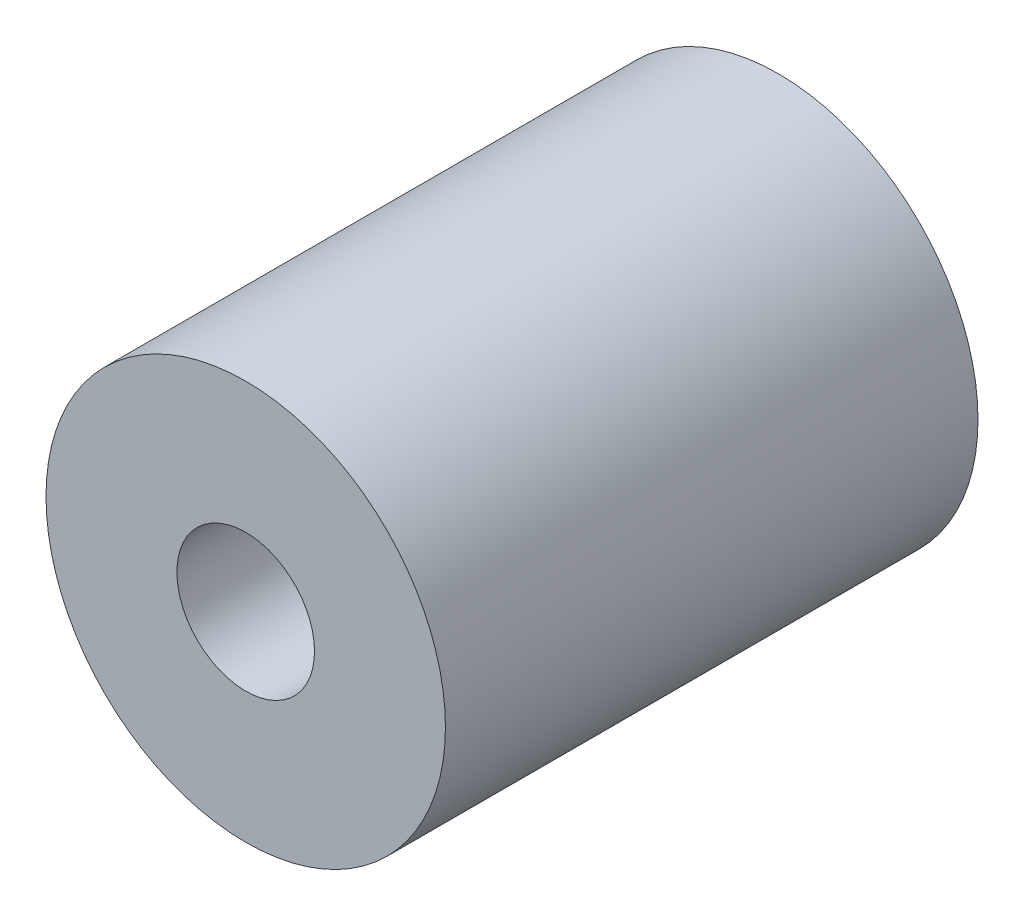
ISO-10303-21;
HEADER;
FILE_DESCRIPTION(('STEP AP214'),'2;1');
FILE_NAME('part.step','',(''),(''),'','','');
FILE_SCHEMA(('AUTOMOTIVE_DESIGN { 1 0 10303 214 1 1 1 1 }'));
ENDSEC;
DATA;
#1=APPLICATION_CONTEXT('core data for automotive mechanical design processes');
#2=APPLICATION_PROTOCOL_DEFINITION('international standard','automotive_design',2000,#1);
#3=PRODUCT_CONTEXT('',#1,'mechanical');
#4=PRODUCT('Part','Part','',(#3));
#5=PRODUCT_RELATED_PRODUCT_CATEGORY('part','',(#4));
#6=PRODUCT_DEFINITION_FORMATION('','',#4);
#7=PRODUCT_DEFINITION_CONTEXT('part definition',#1,'design');
#8=PRODUCT_DEFINITION('design','',#6,#7);
#9=PRODUCT_DEFINITION_SHAPE('','',#8);
#10=(LENGTH_UNIT() NAMED_UNIT(*) SI_UNIT(.MILLI.,.METRE.));
#11=(NAMED_UNIT(*) PLANE_ANGLE_UNIT() SI_UNIT($,.RADIAN.));
#12=(NAMED_UNIT(*) SI_UNIT($,.STERADIAN.) SOLID_ANGLE_UNIT());
#13=UNCERTAINTY_MEASURE_WITH_UNIT(LENGTH_MEASURE(1.E-05),#10,'distance_accuracy_value','');
#14=(GEOMETRIC_REPRESENTATION_CONTEXT(3) GLOBAL_UNCERTAINTY_ASSIGNED_CONTEXT((#13)) GLOBAL_UNIT_ASSIGNED_CONTEXT((#10,
#11,#12)) REPRESENTATION_CONTEXT('',''));
#15=CARTESIAN_POINT('',(0.,0.,0.));
#16=DIRECTION('',(0.,0.,1.));
#17=DIRECTION('',(1.,0.,0.));
#18=AXIS2_PLACEMENT_3D('',#15,#16,#17);
#19=CARTESIAN_POINT('',(0.,0.,24.));
#20=DIRECTION('',(0.,0.,1.));
#21=DIRECTION('',(1.,0.,0.));
#22=AXIS2_PLACEMENT_3D('',#19,#20,#21);
#23=PLANE('',#22);
#24=CARTESIAN_POINT('',(0.,0.,24.));
#25=DIRECTION('',(0.,0.,1.));
#26=DIRECTION('',(1.,0.,0.));
#27=AXIS2_PLACEMENT_3D('',#24,#25,#26);
#28=CIRCLE('',#27,9.);
#29=CARTESIAN_POINT('',(9.,0.,24.));
#30=VERTEX_POINT('',#29);
#31=EDGE_CURVE('E10',#30,#30,#28,.T.);
#32=ORIENTED_EDGE('',*,*,#31,.T.);
#33=EDGE_LOOP('',(#32));
#34=FACE_BOUND('',#33,.T.);
#35=CARTESIAN_POINT('',(0.,0.,24.));
#36=DIRECTION('',(0.,0.,1.));
#37=DIRECTION('',(1.,0.,0.));
#38=AXIS2_PLACEMENT_3D('',#35,#36,#37);
#39=CIRCLE('',#38,3.1);
#40=CARTESIAN_POINT('',(3.1,0.,24.));
#41=VERTEX_POINT('',#40);
#42=EDGE_CURVE('E42',#41,#41,#39,.T.);
#43=ORIENTED_EDGE('',*,*,#42,.F.);
#44=EDGE_LOOP('',(#43));
#45=FACE_BOUND('',#44,.T.);
#46=ADVANCED_FACE('F31',(#34,#45),#23,.T.);
#47=CARTESIAN_POINT('',(0.,0.,0.));
#48=DIRECTION('',(0.,0.,1.));
#49=DIRECTION('',(1.,0.,0.));
#50=AXIS2_PLACEMENT_3D('',#47,#48,#49);
#51=PLANE('',#50);
#52=CARTESIAN_POINT('',(0.,0.,0.));
#53=DIRECTION('',(0.,0.,1.));
#54=DIRECTION('',(1.,0.,0.));
#55=AXIS2_PLACEMENT_3D('',#52,#53,#54);
#56=CIRCLE('',#55,9.);
#57=CARTESIAN_POINT('',(9.,0.,0.));
#58=VERTEX_POINT('',#57);
#59=EDGE_CURVE('E35',#58,#58,#56,.T.);
#60=ORIENTED_EDGE('',*,*,#59,.F.);
#61=EDGE_LOOP('',(#60));
#62=FACE_BOUND('',#61,.T.);
#63=CARTESIAN_POINT('',(0.,0.,0.));
#64=DIRECTION('',(0.,0.,1.));
#65=DIRECTION('',(1.,0.,0.));
#66=AXIS2_PLACEMENT_3D('',#63,#64,#65);
#67=CIRCLE('',#66,3.1);
#68=CARTESIAN_POINT('',(3.1,0.,0.));
#69=VERTEX_POINT('',#68);
#70=EDGE_CURVE('E44',#69,#69,#67,.T.);
#71=ORIENTED_EDGE('',*,*,#70,.T.);
#72=EDGE_LOOP('',(#71));
#73=FACE_BOUND('',#72,.T.);
#74=ADVANCED_FACE('F54',(#62,#73),#51,.F.);
#75=CARTESIAN_POINT('',(0.,0.,24.));
#76=DIRECTION('',(0.,0.,-1.));
#77=DIRECTION('',(-1.,0.,0.));
#78=AXIS2_PLACEMENT_3D('',#75,#76,#77);
#79=CYLINDRICAL_SURFACE('',#78,9.);
#80=ORIENTED_EDGE('',*,*,#31,.F.);
#81=EDGE_LOOP('',(#80));
#82=FACE_BOUND('',#81,.T.);
#83=ORIENTED_EDGE('',*,*,#59,.T.);
#84=EDGE_LOOP('',(#83));
#85=FACE_BOUND('',#84,.T.);
#86=ADVANCED_FACE('F33',(#82,#85),#79,.T.);
#87=CARTESIAN_POINT('',(0.,0.,24.));
#88=DIRECTION('',(0.,0.,-1.));
#89=DIRECTION('',(-1.,0.,0.));
#90=AXIS2_PLACEMENT_3D('',#87,#88,#89);
#91=CYLINDRICAL_SURFACE('',#90,3.1);
#92=ORIENTED_EDGE('',*,*,#42,.T.);
#93=EDGE_LOOP('',(#92));
#94=FACE_BOUND('',#93,.T.);
#95=ORIENTED_EDGE('',*,*,#70,.F.);
#96=EDGE_LOOP('',(#95));
#97=FACE_BOUND('',#96,.T.);
#98=ADVANCED_FACE('F50',(#94,#97),#91,.F.);
#99=CLOSED_SHELL('',(#46,#74,#86,#98));
#100=MANIFOLD_SOLID_BREP('B2',#99);
#101=ADVANCED_BREP_SHAPE_REPRESENTATION('',(#18,#100),#14);
#102=SHAPE_DEFINITION_REPRESENTATION(#9,#101);
ENDSEC;
END-ISO-10303-21;
